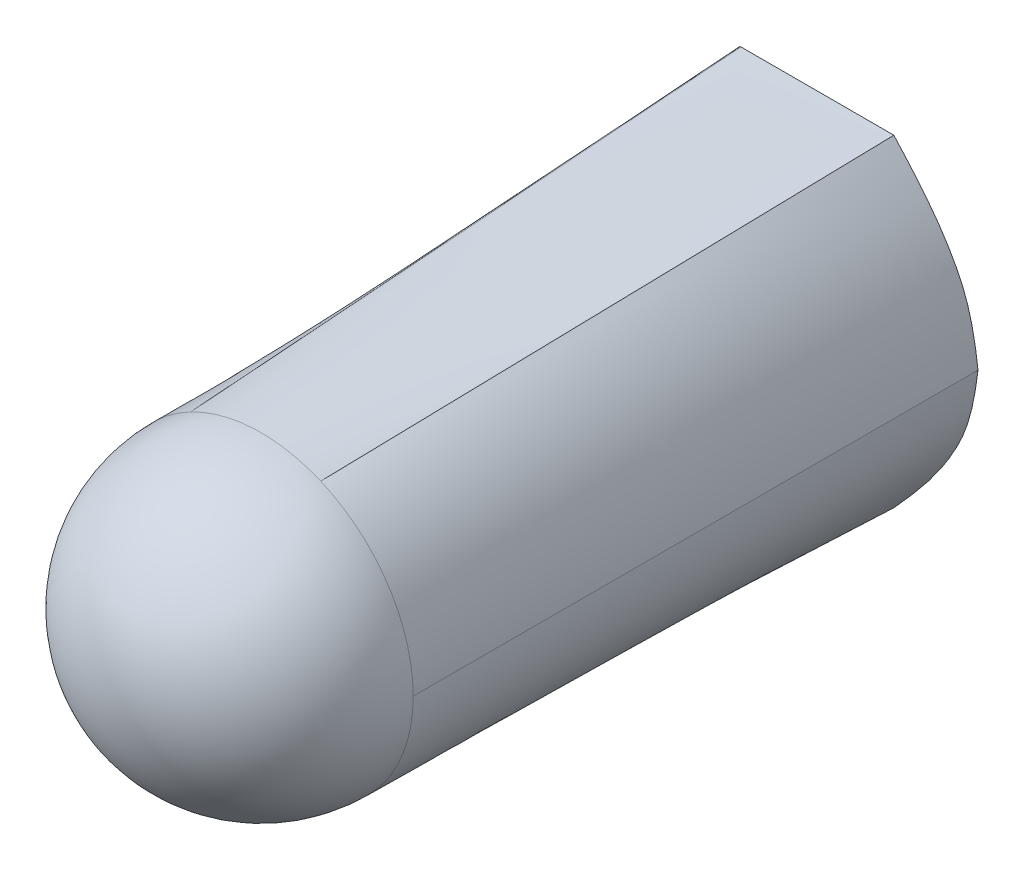
ISO-10303-21;
HEADER;
FILE_DESCRIPTION(('STEP AP214'),'2;1');
FILE_NAME('part.step','',(''),(''),'','','');
FILE_SCHEMA(('AUTOMOTIVE_DESIGN { 1 0 10303 214 1 1 1 1 }'));
ENDSEC;
DATA;
#1=APPLICATION_CONTEXT('core data for automotive mechanical design processes');
#2=APPLICATION_PROTOCOL_DEFINITION('international standard','automotive_design',2000,#1);
#3=PRODUCT_CONTEXT('',#1,'mechanical');
#4=PRODUCT('Part','Part','',(#3));
#5=PRODUCT_RELATED_PRODUCT_CATEGORY('part','',(#4));
#6=PRODUCT_DEFINITION_FORMATION('','',#4);
#7=PRODUCT_DEFINITION_CONTEXT('part definition',#1,'design');
#8=PRODUCT_DEFINITION('design','',#6,#7);
#9=PRODUCT_DEFINITION_SHAPE('','',#8);
#10=(LENGTH_UNIT() NAMED_UNIT(*) SI_UNIT(.MILLI.,.METRE.));
#11=(NAMED_UNIT(*) PLANE_ANGLE_UNIT() SI_UNIT($,.RADIAN.));
#12=(NAMED_UNIT(*) SI_UNIT($,.STERADIAN.) SOLID_ANGLE_UNIT());
#13=UNCERTAINTY_MEASURE_WITH_UNIT(LENGTH_MEASURE(1.E-05),#10,'distance_accuracy_value','');
#14=(GEOMETRIC_REPRESENTATION_CONTEXT(3) GLOBAL_UNCERTAINTY_ASSIGNED_CONTEXT((#13)) GLOBAL_UNIT_ASSIGNED_CONTEXT((#10,
#11,#12)) REPRESENTATION_CONTEXT('',''));
#15=CARTESIAN_POINT('',(0.,0.,0.));
#16=DIRECTION('',(0.,0.,1.));
#17=DIRECTION('',(1.,0.,0.));
#18=AXIS2_PLACEMENT_3D('',#15,#16,#17);
#19=CARTESIAN_POINT('',(-2.9114265083145,-2.03828227090271,0.));
#20=DIRECTION('',(0.,0.,-1.));
#21=DIRECTION('',(-1.,0.,0.));
#22=AXIS2_PLACEMENT_3D('',#19,#20,#21);
#23=PLANE('',#22);
#24=CARTESIAN_POINT('',(-4.2444684424018,0.,0.));
#25=CARTESIAN_POINT('',(-4.24446844240179,-0.107452137173839,0.));
#26=CARTESIAN_POINT('',(-4.23748466742272,-0.21405566133606,0.));
#27=CARTESIAN_POINT('',(-4.1957781377489,-0.423892088590512,0.));
#28=CARTESIAN_POINT('',(-4.16070837934454,-0.527272439571958,0.));
#29=CARTESIAN_POINT('',(-4.03642800277879,-0.704643229518786,0.));
#30=CARTESIAN_POINT('',(-3.95135915448995,-0.772693372705895,0.));
#31=CARTESIAN_POINT('',(-3.76877677289554,-0.88744750748211,0.));
#32=CARTESIAN_POINT('',(-3.67237685578229,-0.936320531094865,0.));
#33=CARTESIAN_POINT('',(-3.48913373849145,-1.0499747977359,0.));
#34=CARTESIAN_POINT('',(-3.40296696979009,-1.1134642149528,0.));
#35=CARTESIAN_POINT('',(-3.25410794137238,-1.26441937833438,0.));
#36=CARTESIAN_POINT('',(-3.18968714114727,-1.35285361970208,0.));
#37=CARTESIAN_POINT('',(-3.02971312698185,-1.63004372531452,0.));
#38=CARTESIAN_POINT('',(-2.96379094531494,-1.83140529367522,0.));
#39=CARTESIAN_POINT('',(-2.85906207131406,-2.2451592481302,0.));
#40=CARTESIAN_POINT('',(-2.8220385375043,-2.45532924702613,0.));
#41=CARTESIAN_POINT('',(-2.75723498235252,-2.87636464168828,0.));
#42=CARTESIAN_POINT('',(-2.72978803805141,-3.08767854822898,0.));
#43=CARTESIAN_POINT('',(-2.67187097706575,-3.50982055733704,0.));
#44=CARTESIAN_POINT('',(-2.64207653474063,-3.72086596333578,0.));
#45=CARTESIAN_POINT('',(-2.58181607741194,-4.03414721985315,0.));
#46=CARTESIAN_POINT('',(-2.55933842948337,-4.13807708960366,0.));
#47=CARTESIAN_POINT('',(-2.51388823216451,-4.29153165547058,0.));
#48=CARTESIAN_POINT('',(-2.49689650721585,-4.34260776258866,0.));
#49=CARTESIAN_POINT('',(-2.46266282229695,-4.41485926277032,0.));
#50=CARTESIAN_POINT('',(-2.44970915023529,-4.43866246966747,0.));
#51=CARTESIAN_POINT('',(-2.4159113647867,-4.48053300000075,0.));
#52=CARTESIAN_POINT('',(-2.39304628903056,-4.49993783999961,0.));
#53=CARTESIAN_POINT('',(-2.36567545377195,-4.49999984696238,0.));
#54=B_SPLINE_CURVE_WITH_KNOTS('',3,(#24,#25,#26,#27,#28,#29,#30,#31,#32,#33,#34,#35,#36,#37,#38,
#39,#40,#41,#42,#43,#44,#45,#46,#47,#48,#49,#50,#51,#52,#53),.UNSPECIFIED.,.F.,.F.,(4,2,2,2,2,2,
2,2,2,2,2,2,2,2,4),(0.,0.0624999999999999,0.125,0.1875,0.25,0.3125,0.375,0.5,0.625,0.75,
0.875000000000001,0.937500000000001,0.968750000000001,0.984375,1.),.UNSPECIFIED.);
#55=CARTESIAN_POINT('',(-4.2444684424018,0.,0.));
#56=VERTEX_POINT('',#55);
#57=CARTESIAN_POINT('',(-2.36567544372528,-4.49994332253681,0.));
#58=VERTEX_POINT('',#57);
#59=EDGE_CURVE('E266',#56,#58,#54,.T.);
#60=ORIENTED_EDGE('',*,*,#59,.F.);
#61=CARTESIAN_POINT('',(-2.36567641502914,4.49999984477696,0.));
#62=CARTESIAN_POINT('',(-2.39266723234827,4.49993826362158,0.));
#63=CARTESIAN_POINT('',(-2.41523918985877,4.4811286371027,0.));
#64=CARTESIAN_POINT('',(-2.44901158075446,4.43975431880796,0.));
#65=CARTESIAN_POINT('',(-2.46179946218254,4.41647004850654,0.));
#66=CARTESIAN_POINT('',(-2.49620325571585,4.34447208449066,0.));
#67=CARTESIAN_POINT('',(-2.51310662561795,4.2938925011295,0.));
#68=CARTESIAN_POINT('',(-2.55863010921527,4.14100451994068,0.));
#69=CARTESIAN_POINT('',(-2.58121900656018,4.03695619625527,0.));
#70=CARTESIAN_POINT('',(-2.64162849403424,3.72377349616821,0.));
#71=CARTESIAN_POINT('',(-2.67139933409105,3.51312492128009,0.));
#72=CARTESIAN_POINT('',(-2.72926944644447,3.09158948704992,0.));
#73=CARTESIAN_POINT('',(-2.75666763726496,2.88053651848335,0.));
#74=CARTESIAN_POINT('',(-2.82120962184821,2.46023942385809,0.));
#75=CARTESIAN_POINT('',(-2.85794191936113,2.2509189216211,0.));
#76=CARTESIAN_POINT('',(-2.96181370830197,1.83792167518118,0.));
#77=CARTESIAN_POINT('',(-3.02930181937602,1.63107975854107,0.));
#78=CARTESIAN_POINT('',(-3.18903039751784,1.35383120128005,0.));
#79=CARTESIAN_POINT('',(-3.25319092695218,1.26539867427861,0.));
#80=CARTESIAN_POINT('',(-3.40339892322715,1.1129769694454,0.));
#81=CARTESIAN_POINT('',(-3.49079497620113,1.0488324233786,0.));
#82=CARTESIAN_POINT('',(-3.67411262886622,0.935358050885582,0.));
#83=CARTESIAN_POINT('',(-3.770740337577,0.886358904806014,0.));
#84=CARTESIAN_POINT('',(-3.90705110667896,0.8004666264081,0.));
#85=CARTESIAN_POINT('',(-3.95083902183506,0.769620440930179,0.));
#86=CARTESIAN_POINT('',(-4.03172144220608,0.698935538955371,0.));
#87=CARTESIAN_POINT('',(-4.06895513185411,0.658465438766408,0.));
#88=CARTESIAN_POINT('',(-4.16059758035169,0.52693048284131,0.));
#89=CARTESIAN_POINT('',(-4.1962647937693,0.422001690668502,0.));
#90=CARTESIAN_POINT('',(-4.23746728012239,0.213578666792449,0.));
#91=CARTESIAN_POINT('',(-4.2444684424018,0.107317024848092,0.));
#92=CARTESIAN_POINT('',(-4.2444684424018,0.,0.));
#93=B_SPLINE_CURVE_WITH_KNOTS('',3,(#61,#62,#63,#64,#65,#66,#67,#68,#69,#70,#71,#72,#73,#74,#75,
#76,#77,#78,#79,#80,#81,#82,#83,#84,#85,#86,#87,#88,#89,#90,#91,#92),.UNSPECIFIED.,.F.,.F.,(4,2,
2,2,2,2,2,2,2,2,2,2,2,2,2,4),(0.,0.0156250000000003,0.0312500000000007,0.0625000000000006,
0.125000000000001,0.25,0.375,0.5,0.625,0.6875,0.75,0.8125,0.84375,0.875,0.9375,1.),.UNSPECIFIED.);
#94=CARTESIAN_POINT('',(-2.36567641502914,4.49999984477696,0.));
#95=VERTEX_POINT('',#94);
#96=EDGE_CURVE('E12',#95,#56,#93,.T.);
#97=ORIENTED_EDGE('',*,*,#96,.F.);
#98=DIRECTION('',(-0.999999999999999,-3.64033009505512E-08,0.));
#99=VECTOR('',#98,1.);
#100=CARTESIAN_POINT('',(1.89830628163759,4.50000000000001,0.));
#101=LINE('',#100,#99);
#102=CARTESIAN_POINT('',(1.89830628163759,4.50000000000001,0.));
#103=VERTEX_POINT('',#102);
#104=EDGE_CURVE('E139',#103,#95,#101,.T.);
#105=ORIENTED_EDGE('',*,*,#104,.F.);
#106=CARTESIAN_POINT('',(4.24446844240487,0.,0.));
#107=CARTESIAN_POINT('',(4.19297694506029,0.431086302225914,0.));
#108=CARTESIAN_POINT('',(4.12394759057546,0.85874194869877,0.));
#109=CARTESIAN_POINT('',(3.94453324890741,1.48538410038366,0.));
#110=CARTESIAN_POINT('',(3.87116008839568,1.68994340914965,0.));
#111=CARTESIAN_POINT('',(3.69485829722378,2.08357662911512,0.));
#112=CARTESIAN_POINT('',(3.59202500957753,2.27356174145487,0.));
#113=CARTESIAN_POINT('',(3.26500305794106,2.83489902735797,0.));
#114=CARTESIAN_POINT('',(3.01342528947052,3.18642479209752,0.));
#115=CARTESIAN_POINT('',(2.47470252128366,3.85804242651396,0.));
#116=CARTESIAN_POINT('',(2.18944713101147,4.18133800367739,0.));
#117=CARTESIAN_POINT('',(1.89830628163759,4.50000000000001,0.));
#118=B_SPLINE_CURVE_WITH_KNOTS('',3,(#106,#107,#108,#109,#110,#111,#112,#113,#114,#115,#116,
#117),.UNSPECIFIED.,.F.,.F.,(4,2,2,2,2,4),(0.,0.25,0.375,0.5,0.75,1.),.UNSPECIFIED.);
#119=CARTESIAN_POINT('',(4.24446844240487,0.,0.));
#120=VERTEX_POINT('',#119);
#121=EDGE_CURVE('E275',#120,#103,#118,.T.);
#122=ORIENTED_EDGE('',*,*,#121,.F.);
#123=CARTESIAN_POINT('',(1.89830650510485,-4.5,0.));
#124=CARTESIAN_POINT('',(2.19200070628004,-4.17854326209063,0.));
#125=CARTESIAN_POINT('',(2.47995771776774,-3.85217511479614,0.));
#126=CARTESIAN_POINT('',(3.02418199148064,-3.17231032341502,0.));
#127=CARTESIAN_POINT('',(3.2763242879497,-2.81772039178051,0.));
#128=CARTESIAN_POINT('',(3.60313341251355,-2.25327797647636,0.));
#129=CARTESIAN_POINT('',(3.70654167461264,-2.06033453664315,0.));
#130=CARTESIAN_POINT('',(3.88015540069077,-1.66665892962217,0.));
#131=CARTESIAN_POINT('',(3.95094083297796,-1.46535857564933,0.));
#132=CARTESIAN_POINT('',(4.12480901608936,-0.850737175923852,0.));
#133=CARTESIAN_POINT('',(4.19336944819392,-0.427800410342597,0.));
#134=CARTESIAN_POINT('',(4.24446844240487,0.,0.));
#135=B_SPLINE_CURVE_WITH_KNOTS('',3,(#123,#124,#125,#126,#127,#128,#129,#130,#131,#132,#133,
#134),.UNSPECIFIED.,.F.,.F.,(4,2,2,2,2,4),(0.,0.25,0.5,0.625,0.75,1.),.UNSPECIFIED.);
#136=CARTESIAN_POINT('',(1.89830650510485,-4.5,0.));
#137=VERTEX_POINT('',#136);
#138=EDGE_CURVE('E202',#137,#120,#135,.T.);
#139=ORIENTED_EDGE('',*,*,#138,.F.);
#140=DIRECTION('',(0.999999999999999,-3.58907760665152E-08,0.));
#141=VECTOR('',#140,1.);
#142=CARTESIAN_POINT('',(-2.36567545377195,-4.49999984696238,0.));
#143=LINE('',#142,#141);
#144=EDGE_CURVE('E269',#58,#137,#143,.T.);
#145=ORIENTED_EDGE('',*,*,#144,.F.);
#146=EDGE_LOOP('',(#60,#97,#105,#122,#139,#145));
#147=FACE_BOUND('',#146,.T.);
#148=ADVANCED_FACE('F128',(#147),#23,.T.);
#149=CARTESIAN_POINT('',(-1.9623191719475,3.76361738570116,15.755));
#150=CARTESIAN_POINT('',(-2.36567641502914,4.49999984477696,0.));
#151=CARTESIAN_POINT('',(-0.835177404514672,4.3512998393266,15.755));
#152=CARTESIAN_POINT('',(-0.944348849473566,4.49999989651798,0.));
#153=CARTESIAN_POINT('',(0.496291342365667,4.40284300108787,15.755));
#154=CARTESIAN_POINT('',(0.476978716082013,4.49999994825899,0.));
#155=CARTESIAN_POINT('',(1.66549200205536,3.90405542348394,15.755));
#156=CARTESIAN_POINT('',(1.89830628163759,4.50000000000001,0.));
#157=B_SPLINE_SURFACE_WITH_KNOTS('',3,1,((#149,#150),(#151,#152),(#153,#154),(#155,#156)),
.UNSPECIFIED.,.F.,.F.,.F.,(4,4),(2,2),(0.,1.),(0.,1.),.UNSPECIFIED.);
#158=CARTESIAN_POINT('',(0.,0.,15.755));
#159=DIRECTION('',(0.,0.,1.));
#160=DIRECTION('',(1.,0.,0.));
#161=AXIS2_PLACEMENT_3D('',#158,#159,#160);
#162=CIRCLE('',#161,4.2444684424018);
#163=CARTESIAN_POINT('',(1.6655962913133,3.90429988640696,15.755));
#164=VERTEX_POINT('',#163);
#165=CARTESIAN_POINT('',(-1.96244204783645,3.76385305471899,15.755));
#166=VERTEX_POINT('',#165);
#167=EDGE_CURVE('E192',#164,#166,#162,.T.);
#168=DIRECTION('',(0.0147649980127823,0.0377945910524799,-0.999176442737147));
#169=VECTOR('',#168,1.);
#170=CARTESIAN_POINT('',(1.78189914184648,4.20202771174197,7.8775));
#171=LINE('',#170,#169);
#172=EDGE_CURVE('E185',#164,#103,#171,.T.);
#173=DIRECTION('',(0.0255655781499019,-0.0466733736126531,0.998582994752802));
#174=VECTOR('',#173,1.);
#175=CARTESIAN_POINT('',(-2.16399779348832,4.13180861523906,7.8775));
#176=LINE('',#175,#174);
#177=EDGE_CURVE('E191',#95,#166,#176,.T.);
#178=ORIENTED_EDGE('',*,*,#167,.F.);
#179=ORIENTED_EDGE('',*,*,#172,.T.);
#180=ORIENTED_EDGE('',*,*,#104,.T.);
#181=ORIENTED_EDGE('',*,*,#177,.T.);
#182=EDGE_LOOP('',(#178,#179,#180,#181));
#183=FACE_BOUND('',#182,.T.);
#184=ADVANCED_FACE('F230',(#183),#157,.T.);
#185=CARTESIAN_POINT('',(1.66549200205536,3.90405542348394,15.755));
#186=CARTESIAN_POINT('',(1.89830628163759,4.50000000000001,0.));
#187=CARTESIAN_POINT('',(2.05643012597831,3.73727902098319,15.755));
#188=CARTESIAN_POINT('',(2.18944713101147,4.18133800367739,0.));
#189=CARTESIAN_POINT('',(2.591412760203,3.40557622219948,15.755));
#190=CARTESIAN_POINT('',(2.61705626621112,3.69693431941331,0.));
#191=CARTESIAN_POINT('',(3.17999748927396,2.83334585473577,15.755));
#192=CARTESIAN_POINT('',(3.14001731149379,3.01152750680901,0.));
#193=CARTESIAN_POINT('',(3.55360422448559,2.3474721998402,15.755));
#194=CARTESIAN_POINT('',(3.49003075510242,2.46450266609075,0.));
#195=CARTESIAN_POINT('',(3.85391006146167,1.81317677089179,15.755));
#196=CARTESIAN_POINT('',(3.79755420795364,1.89390365159486,0.));
#197=CARTESIAN_POINT('',(4.07544591355823,1.23873867313547,15.755));
#198=CARTESIAN_POINT('',(4.01768581246952,1.28043239554276,0.));
#199=CARTESIAN_POINT('',(4.21274269413134,0.63243701181618,15.755));
#200=CARTESIAN_POINT('',(4.15811239914993,0.644189437720584,0.));
#201=CARTESIAN_POINT('',(4.2444684424018,0.21251293205796,15.755));
#202=CARTESIAN_POINT('',(4.21872269373258,0.215543151112958,0.));
#203=CARTESIAN_POINT('',(4.2444684424018,0.,15.755));
#204=CARTESIAN_POINT('',(4.24446844240487,0.,0.));
#205=B_SPLINE_SURFACE_WITH_KNOTS('',3,1,((#185,#186),(#187,#188),(#189,#190),(#191,#192),(#193,
#194),(#195,#196),(#197,#198),(#199,#200),(#201,#202),(#203,#204)),.UNSPECIFIED.,.F.,.F.,.F.,(4,
1,1,1,1,1,1,4),(2,2),(0.,0.25,0.375,0.5,0.625,0.75,0.875,1.),(0.,1.),.UNSPECIFIED.);
#206=CARTESIAN_POINT('',(4.2447342212009,0.,15.755));
#207=VERTEX_POINT('',#206);
#208=EDGE_CURVE('E132',#207,#164,#162,.T.);
#209=DIRECTION('',(1.94998113357977E-13,0.,-1.));
#210=VECTOR('',#209,1.);
#211=CARTESIAN_POINT('',(4.24446844240333,0.,7.8775));
#212=LINE('',#211,#210);
#213=EDGE_CURVE('E183',#207,#120,#212,.T.);
#214=ORIENTED_EDGE('',*,*,#208,.F.);
#215=ORIENTED_EDGE('',*,*,#213,.T.);
#216=ORIENTED_EDGE('',*,*,#121,.T.);
#217=ORIENTED_EDGE('',*,*,#172,.F.);
#218=EDGE_LOOP('',(#214,#215,#216,#217));
#219=FACE_BOUND('',#218,.T.);
#220=ADVANCED_FACE('F181',(#219),#205,.T.);
#221=CARTESIAN_POINT('',(1.66416763765203,-3.90462013931399,15.755));
#222=CARTESIAN_POINT('',(1.89830650510485,-4.5,0.));
#223=CARTESIAN_POINT('',(1.37462916690329,-4.02802280991538,15.755));
#224=CARTESIAN_POINT('',(1.54557037294591,-4.49999998734003,0.));
#225=CARTESIAN_POINT('',(0.771415639555004,-4.20886701796518,15.755));
#226=CARTESIAN_POINT('',(0.836271429522281,-4.49999996188274,0.));
#227=CARTESIAN_POINT('',(-0.165486361259243,-4.27556806620524,15.755));
#228=CARTESIAN_POINT('',(-0.233603526520548,-4.49999992348409,0.));
#229=CARTESIAN_POINT('',(-1.0943973443257,-4.13665290639611,15.755));
#230=CARTESIAN_POINT('',(-1.30351663279587,-4.49999988508409,0.));
#231=CARTESIAN_POINT('',(-1.68176890589873,-3.90975681233175,15.755));
#232=CARTESIAN_POINT('',(-2.012890492807,-4.49999985962411,0.));
#233=CARTESIAN_POINT('',(-1.9821108950188,-3.75330820193779,15.755));
#234=CARTESIAN_POINT('',(-2.39252561541209,-4.49993901955403,0.));
#235=CARTESIAN_POINT('',(-2.0244160493198,-3.73081130454809,15.755));
#236=CARTESIAN_POINT('',(-2.43738553419538,-4.46223829928457,0.));
#237=CARTESIAN_POINT('',(-2.10828028413187,-3.68436839434885,15.755));
#238=CARTESIAN_POINT('',(-2.48786807979208,-4.36821050379472,0.));
#239=CARTESIAN_POINT('',(-2.21166629444757,-3.62362611106884,15.755));
#240=CARTESIAN_POINT('',(-2.53133141781433,-4.24038350139114,0.));
#241=CARTESIAN_POINT('',(-2.33327339020903,-3.54652456510333,15.755));
#242=CARTESIAN_POINT('',(-2.57076312772479,-4.08482491057228,0.));
#243=CARTESIAN_POINT('',(-2.45227910585471,-3.46530323992833,15.755));
#244=CARTESIAN_POINT('',(-2.60310697427628,-3.92717914029227,0.));
#245=CARTESIAN_POINT('',(-2.56853817788623,-3.38005316236385,15.755));
#246=CARTESIAN_POINT('',(-2.63132738020494,-3.76916585010064,0.));
#247=CARTESIAN_POINT('',(-2.6819053428052,-3.29086535922993,15.755));
#248=CARTESIAN_POINT('',(-2.65664052206415,-3.61059407280035,0.));
#249=CARTESIAN_POINT('',(-2.79223533711324,-3.19783085734657,15.755));
#250=CARTESIAN_POINT('',(-2.67970683253639,-3.45185080129107,0.));
#251=CARTESIAN_POINT('',(-2.93509875071154,-3.06877729226286,15.755));
#252=CARTESIAN_POINT('',(-2.70905457441043,-3.24005509659039,0.));
#253=CARTESIAN_POINT('',(-3.10535877369016,-2.89829872313473,15.755));
#254=CARTESIAN_POINT('',(-2.74438696022172,-2.9753342220222,0.));
#255=CARTESIAN_POINT('',(-3.29545381503037,-2.68012128980312,15.755));
#256=CARTESIAN_POINT('',(-2.78957399246634,-2.65829625880345,0.));
#257=CARTESIAN_POINT('',(-3.47042567433312,-2.44939613615339,15.755));
#258=CARTESIAN_POINT('',(-2.84195174668624,-2.34253251705454,0.));
#259=CARTESIAN_POINT('',(-3.62936815579508,-2.20717869224529,15.755));
#260=CARTESIAN_POINT('',(-2.90961488306385,-2.02976523763513,0.));
#261=CARTESIAN_POINT('',(-3.77137506361293,-1.95452438813857,15.755));
#262=CARTESIAN_POINT('',(-2.99961000834307,-1.72259772454898,0.));
#263=CARTESIAN_POINT('',(-3.89588054208245,-1.69271113236918,15.755));
#264=CARTESIAN_POINT('',(-3.1319906835404,-1.43015256431769,0.));
#265=CARTESIAN_POINT('',(-4.00231873549943,-1.42301683347307,15.755));
#266=CARTESIAN_POINT('',(-3.32361370969701,-1.17128370760482,0.));
#267=CARTESIAN_POINT('',(-4.09012378815968,-1.14671939998622,15.755));
#268=CARTESIAN_POINT('',(-3.58481368498449,-0.979310336482024,0.));
#269=CARTESIAN_POINT('',(-4.15872984435897,-0.865096740444566,15.755));
#270=CARTESIAN_POINT('',(-3.86891622174462,-0.839029018114741,0.));
#271=CARTESIAN_POINT('',(-4.20797881427784,-0.579530352013896,15.755));
#272=CARTESIAN_POINT('',(-4.12505810166959,-0.631394522819645,0.));
#273=CARTESIAN_POINT('',(-4.23771260809683,-0.291401731859981,15.755));
#274=CARTESIAN_POINT('',(-4.23132512871229,-0.319051212421529,0.));
#275=CARTESIAN_POINT('',(-4.24441962669659,-0.0985288287190586,15.755));
#276=CARTESIAN_POINT('',(-4.24446844240179,-0.106750790046276,0.));
#277=CARTESIAN_POINT('',(-4.24451620835754,0.0943070510382027,15.755));
#278=CARTESIAN_POINT('',(-4.2444684424018,0.106777791048695,0.));
#279=CARTESIAN_POINT('',(-4.2379980062136,0.287254115552282,15.755));
#280=CARTESIAN_POINT('',(-4.231362096336,0.318728010403807,0.));
#281=CARTESIAN_POINT('',(-4.20853003047865,0.575532171610648,15.755));
#282=CARTESIAN_POINT('',(-4.12485854256284,0.631781909943727,0.));
#283=CARTESIAN_POINT('',(-4.15952510604266,0.86128128443038,15.755));
#284=CARTESIAN_POINT('',(-3.86904486268992,0.839139185828894,0.));
#285=CARTESIAN_POINT('',(-4.09113695672365,1.14311505148559,15.755));
#286=CARTESIAN_POINT('',(-3.58453318788722,0.979343469745449,0.));
#287=CARTESIAN_POINT('',(-4.00351930633962,1.41964707025041,15.755));
#288=CARTESIAN_POINT('',(-3.32360391204166,1.17142695326099,0.));
#289=CARTESIAN_POINT('',(-3.89723761424956,1.68959357493474,15.755));
#290=CARTESIAN_POINT('',(-3.13181508818938,1.43021892981151,0.));
#291=CARTESIAN_POINT('',(-3.77285733981247,1.95167079974853,15.755));
#292=CARTESIAN_POINT('',(-2.9998722999414,1.72283438897964,0.));
#293=CARTESIAN_POINT('',(-3.63094394238734,2.20459497890168,15.755));
#294=CARTESIAN_POINT('',(-2.90951357317127,2.02983847581663,0.));
#295=CARTESIAN_POINT('',(-3.47206288133317,2.44708234660414,15.755));
#296=CARTESIAN_POINT('',(-2.84197093094949,2.34262134528526,0.));
#297=CARTESIAN_POINT('',(-3.29712349687219,2.6780731598307,15.755));
#298=CARTESIAN_POINT('',(-2.78954683722512,2.65833164739301,0.));
#299=CARTESIAN_POINT('',(-3.10703512922663,2.89650767555619,15.755));
#300=CARTESIAN_POINT('',(-2.74439942076236,2.97535452270583,0.));
#301=CARTESIAN_POINT('',(-2.93676178705337,3.06718973822222,15.755));
#302=CARTESIAN_POINT('',(-2.70904901232782,3.24004808694653,0.));
#303=CARTESIAN_POINT('',(-2.7938779619447,3.19639749657932,15.755));
#304=CARTESIAN_POINT('',(-2.67971019643058,3.45183560692349,0.));
#305=CARTESIAN_POINT('',(-2.68352840227526,3.28954321086852,15.755));
#306=CARTESIAN_POINT('',(-2.65664652196102,3.61057150436217,0.));
#307=CARTESIAN_POINT('',(-2.57013803661496,3.37883766208834,15.755));
#308=CARTESIAN_POINT('',(-2.63134198775058,3.76914178995824,0.));
#309=CARTESIAN_POINT('',(-2.45385274981091,3.46418969164802,15.755));
#310=CARTESIAN_POINT('',(-2.60310937069008,3.92715161867558,0.));
#311=CARTESIAN_POINT('',(-2.33481842671018,3.5455081409568,15.755));
#312=CARTESIAN_POINT('',(-2.57076487674007,4.08480077880587,0.));
#313=CARTESIAN_POINT('',(-2.21318095215988,3.62270185142392,15.755));
#314=CARTESIAN_POINT('',(-2.53134311914529,4.24036755944408,0.));
#315=CARTESIAN_POINT('',(-2.10976866786588,3.68351669561951,15.755));
#316=CARTESIAN_POINT('',(-2.48787368408755,4.36820266191843,0.));
#317=CARTESIAN_POINT('',(-2.02588314955298,3.73001504296439,15.755));
#318=CARTESIAN_POINT('',(-2.43739451159489,4.46224354000891,0.));
#319=CARTESIAN_POINT('',(-1.98356731717456,3.75253877741707,15.755));
#320=CARTESIAN_POINT('',(-2.39252964976994,4.49993857752442,0.));
#321=CARTESIAN_POINT('',(-1.9623191719475,3.76361738570116,15.755));
#322=CARTESIAN_POINT('',(-2.36567641502914,4.49999984477696,0.));
#323=B_SPLINE_SURFACE_WITH_KNOTS('',3,1,((#221,#222),(#223,#224),(#225,#226),(#227,#228),(#229,
#230),(#231,#232),(#233,#234),(#235,#236),(#237,#238),(#239,#240),(#241,#242),(#243,#244),(#245,
#246),(#247,#248),(#249,#250),(#251,#252),(#253,#254),(#255,#256),(#257,#258),(#259,#260),(#261,
#262),(#263,#264),(#265,#266),(#267,#268),(#269,#270),(#271,#272),(#273,#274),(#275,#276),(#277,
#278),(#279,#280),(#281,#282),(#283,#284),(#285,#286),(#287,#288),(#289,#290),(#291,#292),(#293,
#294),(#295,#296),(#297,#298),(#299,#300),(#301,#302),(#303,#304),(#305,#306),(#307,#308),(#309,
#310),(#311,#312),(#313,#314),(#315,#316),(#317,#318),(#319,#320),(#321,#322)),.UNSPECIFIED.,
.F.,.F.,.F.,(4,1,1,1,2,1,1,1,1,1,1,1,1,1,1,1,1,1,1,1,1,1,1,1,1,2,1,1,1,1,1,1,1,1,1,1,1,1,1,1,1,
1,1,1,1,1,4),(2,2),(0.,0.0727598013076618,0.145519602615324,0.218279403922986,0.291039205230647,
0.296577102704905,0.302115000179163,0.313190795127678,0.324266590076193,0.335342385024709,
0.346418179973224,0.357493974921739,0.368569769870255,0.37964556481877,0.401797154715801,
0.423948744612831,0.446100334509862,0.468251924406893,0.490403514303924,0.512555104200954,
0.534706694097985,0.556858283995016,0.579009873892046,0.601161463789077,0.623313053686108,
0.645464643583138,0.667623103359192,0.689781563135246,0.7119400229113,0.734098482687354,
0.756256942463408,0.778415402239462,0.800573862015515,0.822732321791569,0.844890781567623,
0.867049241343677,0.889207701119731,0.911366160895785,0.922445390783811,0.933524620671838,
0.944603850559866,0.955683080447892,0.966762310335919,0.977841540223946,0.988920770111973,
0.994460385055987,1.),(0.,1.),.UNSPECIFIED.);
#324=CARTESIAN_POINT('',(1.66427184398134,-3.9048646375982,15.755));
#325=VERTEX_POINT('',#324);
#326=EDGE_CURVE('E210',#166,#325,#162,.T.);
#327=DIRECTION('',(0.0148490045195844,-0.037758781095914,-0.999176551723932));
#328=VECTOR('',#327,1.);
#329=CARTESIAN_POINT('',(1.78123707137844,-4.20231006965699,7.8775));
#330=LINE('',#329,#328);
#331=EDGE_CURVE('E205',#325,#137,#330,.T.);
#332=ORIENTED_EDGE('',*,*,#326,.F.);
#333=ORIENTED_EDGE('',*,*,#177,.F.);
#334=ORIENTED_EDGE('',*,*,#96,.T.);
#335=ORIENTED_EDGE('',*,*,#59,.T.);
#336=ORIENTED_EDGE('',*,*,#144,.T.);
#337=ORIENTED_EDGE('',*,*,#331,.F.);
#338=EDGE_LOOP('',(#332,#333,#334,#335,#336,#337));
#339=FACE_BOUND('',#338,.T.);
#340=ADVANCED_FACE('F314',(#339),#323,.T.);
#341=CARTESIAN_POINT('',(4.2444684424018,0.,15.755));
#342=CARTESIAN_POINT('',(4.24446844240487,0.,0.));
#343=CARTESIAN_POINT('',(4.2444684424018,-0.212578267989153,15.755));
#344=CARTESIAN_POINT('',(4.2189189452994,-0.2139002051713,0.));
#345=CARTESIAN_POINT('',(4.21272340246624,-0.63262817193789,15.755));
#346=CARTESIAN_POINT('',(4.15878473650779,-0.639072215154253,0.));
#347=CARTESIAN_POINT('',(4.07534599262806,-1.23909772219119,15.755));
#348=CARTESIAN_POINT('',(4.02135668089967,-1.26416097630407,0.));
#349=CARTESIAN_POINT('',(3.85368400272688,-1.81367655719358,15.755));
#350=CARTESIAN_POINT('',(3.80940483661335,-1.86754946840086,0.));
#351=CARTESIAN_POINT('',(3.55321270263455,-2.34807926736398,15.755));
#352=CARTESIAN_POINT('',(3.50091347272177,-2.44651898014972,0.));
#353=CARTESIAN_POINT('',(3.17940736222292,-2.83402044312127,15.755));
#354=CARTESIAN_POINT('',(3.15156806461425,-2.99495024769562,0.));
#355=CARTESIAN_POINT('',(2.59052188107748,-3.4062794188054,15.755));
#356=CARTESIAN_POINT('',(2.6234676073439,-3.69009643089916,0.));
#357=CARTESIAN_POINT('',(2.05528251935498,-3.73792512020555,15.755));
#358=CARTESIAN_POINT('',(2.19200070628004,-4.17854326209063,0.));
#359=CARTESIAN_POINT('',(1.66416763765203,-3.90462013931399,15.755));
#360=CARTESIAN_POINT('',(1.89830650510485,-4.5,0.));
#361=B_SPLINE_SURFACE_WITH_KNOTS('',3,1,((#341,#342),(#343,#344),(#345,#346),(#347,#348),(#349,
#350),(#351,#352),(#353,#354),(#355,#356),(#357,#358),(#359,#360)),.UNSPECIFIED.,.F.,.F.,.F.,(4,
1,1,1,1,1,1,4),(2,2),(0.,0.125,0.25,0.375,0.5,0.625,0.75,1.),(0.,1.),.UNSPECIFIED.);
#362=EDGE_CURVE('E199',#325,#207,#162,.T.);
#363=ORIENTED_EDGE('',*,*,#362,.F.);
#364=ORIENTED_EDGE('',*,*,#331,.T.);
#365=ORIENTED_EDGE('',*,*,#138,.T.);
#366=ORIENTED_EDGE('',*,*,#213,.F.);
#367=EDGE_LOOP('',(#363,#364,#365,#366));
#368=FACE_BOUND('',#367,.T.);
#369=ADVANCED_FACE('F197',(#368),#361,.T.);
#370=CARTESIAN_POINT('',(0.,0.,15.755));
#371=DIRECTION('',(0.,0.,-1.));
#372=DIRECTION('',(-1.,0.,0.));
#373=AXIS2_PLACEMENT_3D('',#370,#371,#372);
#374=SPHERICAL_SURFACE('',#373,4.245);
#375=ORIENTED_EDGE('',*,*,#167,.T.);
#376=ORIENTED_EDGE('',*,*,#326,.T.);
#377=ORIENTED_EDGE('',*,*,#362,.T.);
#378=ORIENTED_EDGE('',*,*,#208,.T.);
#379=EDGE_LOOP('',(#375,#376,#377,#378));
#380=FACE_BOUND('',#379,.T.);
#381=ADVANCED_FACE('F209',(#380),#374,.T.);
#382=CLOSED_SHELL('',(#148,#184,#220,#340,#369,#381));
#383=MANIFOLD_SOLID_BREP('B2',#382);
#384=ADVANCED_BREP_SHAPE_REPRESENTATION('',(#18,#383),#14);
#385=SHAPE_DEFINITION_REPRESENTATION(#9,#384);
ENDSEC;
END-ISO-10303-21;
